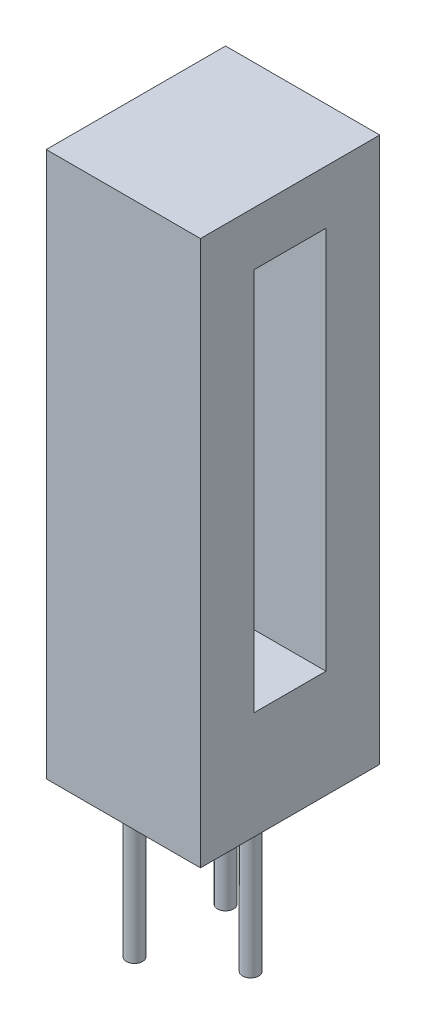
ISO-10303-21;
HEADER;
FILE_DESCRIPTION(('STEP AP214'),'2;1');
FILE_NAME('part.step','',(''),(''),'','','');
FILE_SCHEMA(('AUTOMOTIVE_DESIGN { 1 0 10303 214 1 1 1 1 }'));
ENDSEC;
DATA;
#1=APPLICATION_CONTEXT('core data for automotive mechanical design processes');
#2=APPLICATION_PROTOCOL_DEFINITION('international standard','automotive_design',2000,#1);
#3=PRODUCT_CONTEXT('',#1,'mechanical');
#4=PRODUCT('Part','Part','',(#3));
#5=PRODUCT_RELATED_PRODUCT_CATEGORY('part','',(#4));
#6=PRODUCT_DEFINITION_FORMATION('','',#4);
#7=PRODUCT_DEFINITION_CONTEXT('part definition',#1,'design');
#8=PRODUCT_DEFINITION('design','',#6,#7);
#9=PRODUCT_DEFINITION_SHAPE('','',#8);
#10=(LENGTH_UNIT() NAMED_UNIT(*) SI_UNIT(.MILLI.,.METRE.));
#11=(NAMED_UNIT(*) PLANE_ANGLE_UNIT() SI_UNIT($,.RADIAN.));
#12=(NAMED_UNIT(*) SI_UNIT($,.STERADIAN.) SOLID_ANGLE_UNIT());
#13=UNCERTAINTY_MEASURE_WITH_UNIT(LENGTH_MEASURE(1.E-05),#10,'distance_accuracy_value','');
#14=(GEOMETRIC_REPRESENTATION_CONTEXT(3) GLOBAL_UNCERTAINTY_ASSIGNED_CONTEXT((#13)) GLOBAL_UNIT_ASSIGNED_CONTEXT((#10,
#11,#12)) REPRESENTATION_CONTEXT('',''));
#15=CARTESIAN_POINT('',(0.,0.,0.));
#16=DIRECTION('',(0.,0.,1.));
#17=DIRECTION('',(1.,0.,0.));
#18=AXIS2_PLACEMENT_3D('',#15,#16,#17);
#19=CARTESIAN_POINT('',(0.,15.2,-5.));
#20=DIRECTION('',(-1.,0.,0.));
#21=DIRECTION('',(0.,0.,1.));
#22=AXIS2_PLACEMENT_3D('',#19,#20,#21);
#23=PLANE('',#22);
#24=DIRECTION('',(0.,-1.,0.));
#25=VECTOR('',#24,1.);
#26=CARTESIAN_POINT('',(0.,15.2,0.));
#27=LINE('',#26,#25);
#28=CARTESIAN_POINT('',(0.,15.2,0.));
#29=VERTEX_POINT('',#28);
#30=CARTESIAN_POINT('',(0.,0.,0.));
#31=VERTEX_POINT('',#30);
#32=EDGE_CURVE('E147',#29,#31,#27,.T.);
#33=ORIENTED_EDGE('',*,*,#32,.F.);
#34=DIRECTION('',(0.,0.,1.));
#35=VECTOR('',#34,1.);
#36=CARTESIAN_POINT('',(0.,15.2,-5.));
#37=LINE('',#36,#35);
#38=CARTESIAN_POINT('',(0.,15.2,-5.));
#39=VERTEX_POINT('',#38);
#40=EDGE_CURVE('E11',#39,#29,#37,.T.);
#41=ORIENTED_EDGE('',*,*,#40,.F.);
#42=DIRECTION('',(0.,-1.,0.));
#43=VECTOR('',#42,1.);
#44=CARTESIAN_POINT('',(0.,15.2,-5.));
#45=LINE('',#44,#43);
#46=CARTESIAN_POINT('',(0.,0.,-5.));
#47=VERTEX_POINT('',#46);
#48=EDGE_CURVE('E151',#39,#47,#45,.T.);
#49=ORIENTED_EDGE('',*,*,#48,.T.);
#50=DIRECTION('',(0.,0.,1.));
#51=VECTOR('',#50,1.);
#52=CARTESIAN_POINT('',(0.,0.,-5.));
#53=LINE('',#52,#51);
#54=EDGE_CURVE('E39',#47,#31,#53,.T.);
#55=ORIENTED_EDGE('',*,*,#54,.T.);
#56=EDGE_LOOP('',(#33,#41,#49,#55));
#57=FACE_BOUND('',#56,.T.);
#58=ADVANCED_FACE('F36',(#57),#23,.T.);
#59=CARTESIAN_POINT('',(4.3,15.2,-5.));
#60=DIRECTION('',(0.,1.,0.));
#61=DIRECTION('',(-1.,0.,0.));
#62=AXIS2_PLACEMENT_3D('',#59,#60,#61);
#63=PLANE('',#62);
#64=DIRECTION('',(-1.,0.,0.));
#65=VECTOR('',#64,1.);
#66=CARTESIAN_POINT('',(4.3,15.2,0.));
#67=LINE('',#66,#65);
#68=CARTESIAN_POINT('',(4.3,15.2,0.));
#69=VERTEX_POINT('',#68);
#70=EDGE_CURVE('E154',#69,#29,#67,.T.);
#71=ORIENTED_EDGE('',*,*,#70,.F.);
#72=DIRECTION('',(0.,0.,1.));
#73=VECTOR('',#72,1.);
#74=CARTESIAN_POINT('',(4.3,15.2,-5.));
#75=LINE('',#74,#73);
#76=CARTESIAN_POINT('',(4.3,15.2,-5.));
#77=VERTEX_POINT('',#76);
#78=EDGE_CURVE('E44',#77,#69,#75,.T.);
#79=ORIENTED_EDGE('',*,*,#78,.F.);
#80=DIRECTION('',(-1.,0.,0.));
#81=VECTOR('',#80,1.);
#82=CARTESIAN_POINT('',(4.3,15.2,-5.));
#83=LINE('',#82,#81);
#84=EDGE_CURVE('E159',#77,#39,#83,.T.);
#85=ORIENTED_EDGE('',*,*,#84,.T.);
#86=ORIENTED_EDGE('',*,*,#40,.T.);
#87=EDGE_LOOP('',(#71,#79,#85,#86));
#88=FACE_BOUND('',#87,.T.);
#89=ADVANCED_FACE('F176',(#88),#63,.T.);
#90=CARTESIAN_POINT('',(4.3,0.,-5.));
#91=DIRECTION('',(1.,0.,0.));
#92=DIRECTION('',(0.,0.,-1.));
#93=AXIS2_PLACEMENT_3D('',#90,#91,#92);
#94=PLANE('',#93);
#95=DIRECTION('',(0.,0.,-1.));
#96=VECTOR('',#95,1.);
#97=CARTESIAN_POINT('',(4.3,3.,-3.5));
#98=LINE('',#97,#96);
#99=CARTESIAN_POINT('',(4.3,3.,-1.5));
#100=VERTEX_POINT('',#99);
#101=CARTESIAN_POINT('',(4.3,3.,-3.5));
#102=VERTEX_POINT('',#101);
#103=EDGE_CURVE('E52',#100,#102,#98,.T.);
#104=ORIENTED_EDGE('',*,*,#103,.F.);
#105=DIRECTION('',(0.,-1.,0.));
#106=VECTOR('',#105,1.);
#107=CARTESIAN_POINT('',(4.3,3.,-1.5));
#108=LINE('',#107,#106);
#109=CARTESIAN_POINT('',(4.3,13.7,-1.5));
#110=VERTEX_POINT('',#109);
#111=EDGE_CURVE('E128',#110,#100,#108,.T.);
#112=ORIENTED_EDGE('',*,*,#111,.F.);
#113=DIRECTION('',(0.,0.,1.));
#114=VECTOR('',#113,1.);
#115=CARTESIAN_POINT('',(4.3,13.7,-1.5));
#116=LINE('',#115,#114);
#117=CARTESIAN_POINT('',(4.3,13.7,-3.5));
#118=VERTEX_POINT('',#117);
#119=EDGE_CURVE('E131',#118,#110,#116,.T.);
#120=ORIENTED_EDGE('',*,*,#119,.F.);
#121=DIRECTION('',(0.,1.,0.));
#122=VECTOR('',#121,1.);
#123=CARTESIAN_POINT('',(4.3,13.7,-3.5));
#124=LINE('',#123,#122);
#125=EDGE_CURVE('E140',#102,#118,#124,.T.);
#126=ORIENTED_EDGE('',*,*,#125,.F.);
#127=EDGE_LOOP('',(#104,#112,#120,#126));
#128=FACE_BOUND('',#127,.T.);
#129=DIRECTION('',(0.,1.,0.));
#130=VECTOR('',#129,1.);
#131=CARTESIAN_POINT('',(4.3,0.,0.));
#132=LINE('',#131,#130);
#133=CARTESIAN_POINT('',(4.3,0.,0.));
#134=VERTEX_POINT('',#133);
#135=EDGE_CURVE('E166',#134,#69,#132,.T.);
#136=ORIENTED_EDGE('',*,*,#135,.F.);
#137=DIRECTION('',(0.,0.,1.));
#138=VECTOR('',#137,1.);
#139=CARTESIAN_POINT('',(4.3,0.,-5.));
#140=LINE('',#139,#138);
#141=CARTESIAN_POINT('',(4.3,0.,-5.));
#142=VERTEX_POINT('',#141);
#143=EDGE_CURVE('E171',#142,#134,#140,.T.);
#144=ORIENTED_EDGE('',*,*,#143,.F.);
#145=DIRECTION('',(0.,1.,0.));
#146=VECTOR('',#145,1.);
#147=CARTESIAN_POINT('',(4.3,0.,-5.));
#148=LINE('',#147,#146);
#149=EDGE_CURVE('E156',#142,#77,#148,.T.);
#150=ORIENTED_EDGE('',*,*,#149,.T.);
#151=ORIENTED_EDGE('',*,*,#78,.T.);
#152=EDGE_LOOP('',(#136,#144,#150,#151));
#153=FACE_BOUND('',#152,.T.);
#154=ADVANCED_FACE('F180',(#128,#153),#94,.T.);
#155=CARTESIAN_POINT('',(0.,0.,-5.));
#156=DIRECTION('',(0.,-1.,0.));
#157=DIRECTION('',(0.,0.,-1.));
#158=AXIS2_PLACEMENT_3D('',#155,#156,#157);
#159=PLANE('',#158);
#160=CARTESIAN_POINT('',(3.2,0.,-2.5));
#161=DIRECTION('',(0.,-1.,0.));
#162=DIRECTION('',(0.,0.,-1.));
#163=AXIS2_PLACEMENT_3D('',#160,#161,#162);
#164=CIRCLE('',#163,0.225);
#165=CARTESIAN_POINT('',(3.2,0.,-2.725));
#166=VERTEX_POINT('',#165);
#167=EDGE_CURVE('E259',#166,#166,#164,.T.);
#168=ORIENTED_EDGE('',*,*,#167,.F.);
#169=EDGE_LOOP('',(#168));
#170=FACE_BOUND('',#169,.T.);
#171=CARTESIAN_POINT('',(1.23,0.,-3.77));
#172=DIRECTION('',(0.,-1.,0.));
#173=DIRECTION('',(0.,0.,1.));
#174=AXIS2_PLACEMENT_3D('',#171,#172,#173);
#175=CIRCLE('',#174,0.225);
#176=CARTESIAN_POINT('',(1.23,0.,-3.545));
#177=VERTEX_POINT('',#176);
#178=EDGE_CURVE('E258',#177,#177,#175,.T.);
#179=ORIENTED_EDGE('',*,*,#178,.F.);
#180=EDGE_LOOP('',(#179));
#181=FACE_BOUND('',#180,.T.);
#182=CARTESIAN_POINT('',(1.23,0.,-1.23));
#183=DIRECTION('',(0.,-1.,0.));
#184=DIRECTION('',(0.,0.,-1.));
#185=AXIS2_PLACEMENT_3D('',#182,#183,#184);
#186=CIRCLE('',#185,0.225);
#187=CARTESIAN_POINT('',(1.23,0.,-1.455));
#188=VERTEX_POINT('',#187);
#189=EDGE_CURVE('E134',#188,#188,#186,.T.);
#190=ORIENTED_EDGE('',*,*,#189,.F.);
#191=EDGE_LOOP('',(#190));
#192=FACE_BOUND('',#191,.T.);
#193=DIRECTION('',(1.,0.,0.));
#194=VECTOR('',#193,1.);
#195=CARTESIAN_POINT('',(0.,0.,0.));
#196=LINE('',#195,#194);
#197=EDGE_CURVE('E163',#31,#134,#196,.T.);
#198=ORIENTED_EDGE('',*,*,#197,.F.);
#199=ORIENTED_EDGE('',*,*,#54,.F.);
#200=DIRECTION('',(1.,0.,0.));
#201=VECTOR('',#200,1.);
#202=CARTESIAN_POINT('',(0.,0.,-5.));
#203=LINE('',#202,#201);
#204=EDGE_CURVE('E153',#47,#142,#203,.T.);
#205=ORIENTED_EDGE('',*,*,#204,.T.);
#206=ORIENTED_EDGE('',*,*,#143,.T.);
#207=EDGE_LOOP('',(#198,#199,#205,#206));
#208=FACE_BOUND('',#207,.T.);
#209=ADVANCED_FACE('F173',(#170,#181,#192,#208),#159,.T.);
#210=CARTESIAN_POINT('',(0.,0.,-5.));
#211=DIRECTION('',(0.,0.,1.));
#212=DIRECTION('',(1.,0.,0.));
#213=AXIS2_PLACEMENT_3D('',#210,#211,#212);
#214=PLANE('',#213);
#215=ORIENTED_EDGE('',*,*,#48,.F.);
#216=ORIENTED_EDGE('',*,*,#84,.F.);
#217=ORIENTED_EDGE('',*,*,#149,.F.);
#218=ORIENTED_EDGE('',*,*,#204,.F.);
#219=EDGE_LOOP('',(#215,#216,#217,#218));
#220=FACE_BOUND('',#219,.T.);
#221=ADVANCED_FACE('F182',(#220),#214,.F.);
#222=CARTESIAN_POINT('',(0.,0.,0.));
#223=DIRECTION('',(0.,0.,1.));
#224=DIRECTION('',(1.,0.,0.));
#225=AXIS2_PLACEMENT_3D('',#222,#223,#224);
#226=PLANE('',#225);
#227=ORIENTED_EDGE('',*,*,#32,.T.);
#228=ORIENTED_EDGE('',*,*,#197,.T.);
#229=ORIENTED_EDGE('',*,*,#135,.T.);
#230=ORIENTED_EDGE('',*,*,#70,.T.);
#231=EDGE_LOOP('',(#227,#228,#229,#230));
#232=FACE_BOUND('',#231,.T.);
#233=ADVANCED_FACE('F175',(#232),#226,.T.);
#234=CARTESIAN_POINT('',(2.3,3.,-3.5));
#235=DIRECTION('',(0.,-1.,0.));
#236=DIRECTION('',(0.,0.,-1.));
#237=AXIS2_PLACEMENT_3D('',#234,#235,#236);
#238=PLANE('',#237);
#239=ORIENTED_EDGE('',*,*,#103,.T.);
#240=DIRECTION('',(1.,0.,0.));
#241=VECTOR('',#240,1.);
#242=CARTESIAN_POINT('',(2.3,3.,-3.5));
#243=LINE('',#242,#241);
#244=CARTESIAN_POINT('',(2.3,3.,-3.5));
#245=VERTEX_POINT('',#244);
#246=EDGE_CURVE('E106',#245,#102,#243,.T.);
#247=ORIENTED_EDGE('',*,*,#246,.F.);
#248=DIRECTION('',(0.,0.,-1.));
#249=VECTOR('',#248,1.);
#250=CARTESIAN_POINT('',(2.3,3.,-3.5));
#251=LINE('',#250,#249);
#252=CARTESIAN_POINT('',(2.3,3.,-1.5));
#253=VERTEX_POINT('',#252);
#254=EDGE_CURVE('E110',#253,#245,#251,.T.);
#255=ORIENTED_EDGE('',*,*,#254,.F.);
#256=DIRECTION('',(1.,0.,0.));
#257=VECTOR('',#256,1.);
#258=CARTESIAN_POINT('',(2.3,3.,-1.5));
#259=LINE('',#258,#257);
#260=EDGE_CURVE('E145',#253,#100,#259,.T.);
#261=ORIENTED_EDGE('',*,*,#260,.T.);
#262=EDGE_LOOP('',(#239,#247,#255,#261));
#263=FACE_BOUND('',#262,.T.);
#264=ADVANCED_FACE('F108',(#263),#238,.F.);
#265=CARTESIAN_POINT('',(2.3,3.,-1.5));
#266=DIRECTION('',(0.,0.,1.));
#267=DIRECTION('',(1.,0.,0.));
#268=AXIS2_PLACEMENT_3D('',#265,#266,#267);
#269=PLANE('',#268);
#270=ORIENTED_EDGE('',*,*,#111,.T.);
#271=ORIENTED_EDGE('',*,*,#260,.F.);
#272=DIRECTION('',(0.,-1.,0.));
#273=VECTOR('',#272,1.);
#274=CARTESIAN_POINT('',(2.3,3.,-1.5));
#275=LINE('',#274,#273);
#276=CARTESIAN_POINT('',(2.3,13.7,-1.5));
#277=VERTEX_POINT('',#276);
#278=EDGE_CURVE('E116',#277,#253,#275,.T.);
#279=ORIENTED_EDGE('',*,*,#278,.F.);
#280=DIRECTION('',(1.,0.,0.));
#281=VECTOR('',#280,1.);
#282=CARTESIAN_POINT('',(2.3,13.7,-1.5));
#283=LINE('',#282,#281);
#284=EDGE_CURVE('E148',#277,#110,#283,.T.);
#285=ORIENTED_EDGE('',*,*,#284,.T.);
#286=EDGE_LOOP('',(#270,#271,#279,#285));
#287=FACE_BOUND('',#286,.T.);
#288=ADVANCED_FACE('F209',(#287),#269,.F.);
#289=CARTESIAN_POINT('',(2.3,13.7,-1.5));
#290=DIRECTION('',(0.,1.,0.));
#291=DIRECTION('',(0.,0.,1.));
#292=AXIS2_PLACEMENT_3D('',#289,#290,#291);
#293=PLANE('',#292);
#294=ORIENTED_EDGE('',*,*,#119,.T.);
#295=ORIENTED_EDGE('',*,*,#284,.F.);
#296=DIRECTION('',(0.,0.,1.));
#297=VECTOR('',#296,1.);
#298=CARTESIAN_POINT('',(2.3,13.7,-1.5));
#299=LINE('',#298,#297);
#300=CARTESIAN_POINT('',(2.3,13.7,-3.5));
#301=VERTEX_POINT('',#300);
#302=EDGE_CURVE('E124',#301,#277,#299,.T.);
#303=ORIENTED_EDGE('',*,*,#302,.F.);
#304=DIRECTION('',(1.,0.,0.));
#305=VECTOR('',#304,1.);
#306=CARTESIAN_POINT('',(2.3,13.7,-3.5));
#307=LINE('',#306,#305);
#308=EDGE_CURVE('E115',#301,#118,#307,.T.);
#309=ORIENTED_EDGE('',*,*,#308,.T.);
#310=EDGE_LOOP('',(#294,#295,#303,#309));
#311=FACE_BOUND('',#310,.T.);
#312=ADVANCED_FACE('F207',(#311),#293,.F.);
#313=CARTESIAN_POINT('',(2.3,13.7,-3.5));
#314=DIRECTION('',(0.,0.,-1.));
#315=DIRECTION('',(0.,1.,0.));
#316=AXIS2_PLACEMENT_3D('',#313,#314,#315);
#317=PLANE('',#316);
#318=ORIENTED_EDGE('',*,*,#125,.T.);
#319=ORIENTED_EDGE('',*,*,#308,.F.);
#320=DIRECTION('',(0.,1.,0.));
#321=VECTOR('',#320,1.);
#322=CARTESIAN_POINT('',(2.3,13.7,-3.5));
#323=LINE('',#322,#321);
#324=EDGE_CURVE('E119',#245,#301,#323,.T.);
#325=ORIENTED_EDGE('',*,*,#324,.F.);
#326=ORIENTED_EDGE('',*,*,#246,.T.);
#327=EDGE_LOOP('',(#318,#319,#325,#326));
#328=FACE_BOUND('',#327,.T.);
#329=ADVANCED_FACE('F120',(#328),#317,.F.);
#330=CARTESIAN_POINT('',(2.3,0.,0.));
#331=DIRECTION('',(-1.,0.,0.));
#332=DIRECTION('',(0.,0.,1.));
#333=AXIS2_PLACEMENT_3D('',#330,#331,#332);
#334=PLANE('',#333);
#335=ORIENTED_EDGE('',*,*,#254,.T.);
#336=ORIENTED_EDGE('',*,*,#324,.T.);
#337=ORIENTED_EDGE('',*,*,#302,.T.);
#338=ORIENTED_EDGE('',*,*,#278,.T.);
#339=EDGE_LOOP('',(#335,#336,#337,#338));
#340=FACE_BOUND('',#339,.T.);
#341=ADVANCED_FACE('F126',(#340),#334,.F.);
#342=CARTESIAN_POINT('',(1.23,-4.3,-1.23));
#343=DIRECTION('',(0.,1.,0.));
#344=DIRECTION('',(0.,0.,1.));
#345=AXIS2_PLACEMENT_3D('',#342,#343,#344);
#346=CYLINDRICAL_SURFACE('',#345,0.225);
#347=CARTESIAN_POINT('',(1.23,-4.3,-1.23));
#348=DIRECTION('',(0.,-1.,0.));
#349=DIRECTION('',(0.,0.,-1.));
#350=AXIS2_PLACEMENT_3D('',#347,#348,#349);
#351=CIRCLE('',#350,0.225);
#352=CARTESIAN_POINT('',(1.23,-4.3,-1.455));
#353=VERTEX_POINT('',#352);
#354=EDGE_CURVE('E141',#353,#353,#351,.T.);
#355=ORIENTED_EDGE('',*,*,#354,.F.);
#356=EDGE_LOOP('',(#355));
#357=FACE_BOUND('',#356,.T.);
#358=ORIENTED_EDGE('',*,*,#189,.T.);
#359=EDGE_LOOP('',(#358));
#360=FACE_BOUND('',#359,.T.);
#361=ADVANCED_FACE('F224',(#357,#360),#346,.T.);
#362=CARTESIAN_POINT('',(1.23,-4.3,-1.23));
#363=DIRECTION('',(0.,-1.,0.));
#364=DIRECTION('',(0.,0.,-1.));
#365=AXIS2_PLACEMENT_3D('',#362,#363,#364);
#366=PLANE('',#365);
#367=ORIENTED_EDGE('',*,*,#354,.T.);
#368=EDGE_LOOP('',(#367));
#369=FACE_BOUND('',#368,.T.);
#370=ADVANCED_FACE('F228',(#369),#366,.T.);
#371=CARTESIAN_POINT('',(1.23,-4.3,-3.77));
#372=DIRECTION('',(0.,1.,0.));
#373=DIRECTION('',(0.,0.,1.));
#374=AXIS2_PLACEMENT_3D('',#371,#372,#373);
#375=CYLINDRICAL_SURFACE('',#374,0.225);
#376=CARTESIAN_POINT('',(1.23,-4.3,-3.77));
#377=DIRECTION('',(0.,-1.,0.));
#378=DIRECTION('',(0.,0.,1.));
#379=AXIS2_PLACEMENT_3D('',#376,#377,#378);
#380=CIRCLE('',#379,0.225);
#381=CARTESIAN_POINT('',(1.23,-4.3,-3.545));
#382=VERTEX_POINT('',#381);
#383=EDGE_CURVE('E262',#382,#382,#380,.T.);
#384=ORIENTED_EDGE('',*,*,#383,.F.);
#385=EDGE_LOOP('',(#384));
#386=FACE_BOUND('',#385,.T.);
#387=ORIENTED_EDGE('',*,*,#178,.T.);
#388=EDGE_LOOP('',(#387));
#389=FACE_BOUND('',#388,.T.);
#390=ADVANCED_FACE('F233',(#386,#389),#375,.T.);
#391=CARTESIAN_POINT('',(1.23,-4.3,-3.77));
#392=DIRECTION('',(0.,1.,0.));
#393=DIRECTION('',(0.,0.,1.));
#394=AXIS2_PLACEMENT_3D('',#391,#392,#393);
#395=PLANE('',#394);
#396=ORIENTED_EDGE('',*,*,#383,.T.);
#397=EDGE_LOOP('',(#396));
#398=FACE_BOUND('',#397,.T.);
#399=ADVANCED_FACE('F241',(#398),#395,.F.);
#400=CARTESIAN_POINT('',(3.2,-4.3,-2.5));
#401=DIRECTION('',(0.,1.,0.));
#402=DIRECTION('',(0.,0.,1.));
#403=AXIS2_PLACEMENT_3D('',#400,#401,#402);
#404=CYLINDRICAL_SURFACE('',#403,0.225);
#405=CARTESIAN_POINT('',(3.2,-4.3,-2.5));
#406=DIRECTION('',(0.,-1.,0.));
#407=DIRECTION('',(0.,0.,-1.));
#408=AXIS2_PLACEMENT_3D('',#405,#406,#407);
#409=CIRCLE('',#408,0.225);
#410=CARTESIAN_POINT('',(3.2,-4.3,-2.725));
#411=VERTEX_POINT('',#410);
#412=EDGE_CURVE('E257',#411,#411,#409,.T.);
#413=ORIENTED_EDGE('',*,*,#412,.F.);
#414=EDGE_LOOP('',(#413));
#415=FACE_BOUND('',#414,.T.);
#416=ORIENTED_EDGE('',*,*,#167,.T.);
#417=EDGE_LOOP('',(#416));
#418=FACE_BOUND('',#417,.T.);
#419=ADVANCED_FACE('F245',(#415,#418),#404,.T.);
#420=CARTESIAN_POINT('',(3.2,-4.3,-2.5));
#421=DIRECTION('',(0.,-1.,0.));
#422=DIRECTION('',(0.,0.,-1.));
#423=AXIS2_PLACEMENT_3D('',#420,#421,#422);
#424=PLANE('',#423);
#425=ORIENTED_EDGE('',*,*,#412,.T.);
#426=EDGE_LOOP('',(#425));
#427=FACE_BOUND('',#426,.T.);
#428=ADVANCED_FACE('F249',(#427),#424,.T.);
#429=CLOSED_SHELL('',(#58,#89,#154,#209,#221,#233,#264,#288,#312,#329,#341,#361,#370,#390,#399,
#419,#428));
#430=MANIFOLD_SOLID_BREP('B2',#429);
#431=ADVANCED_BREP_SHAPE_REPRESENTATION('',(#18,#430),#14);
#432=SHAPE_DEFINITION_REPRESENTATION(#9,#431);
ENDSEC;
END-ISO-10303-21;
